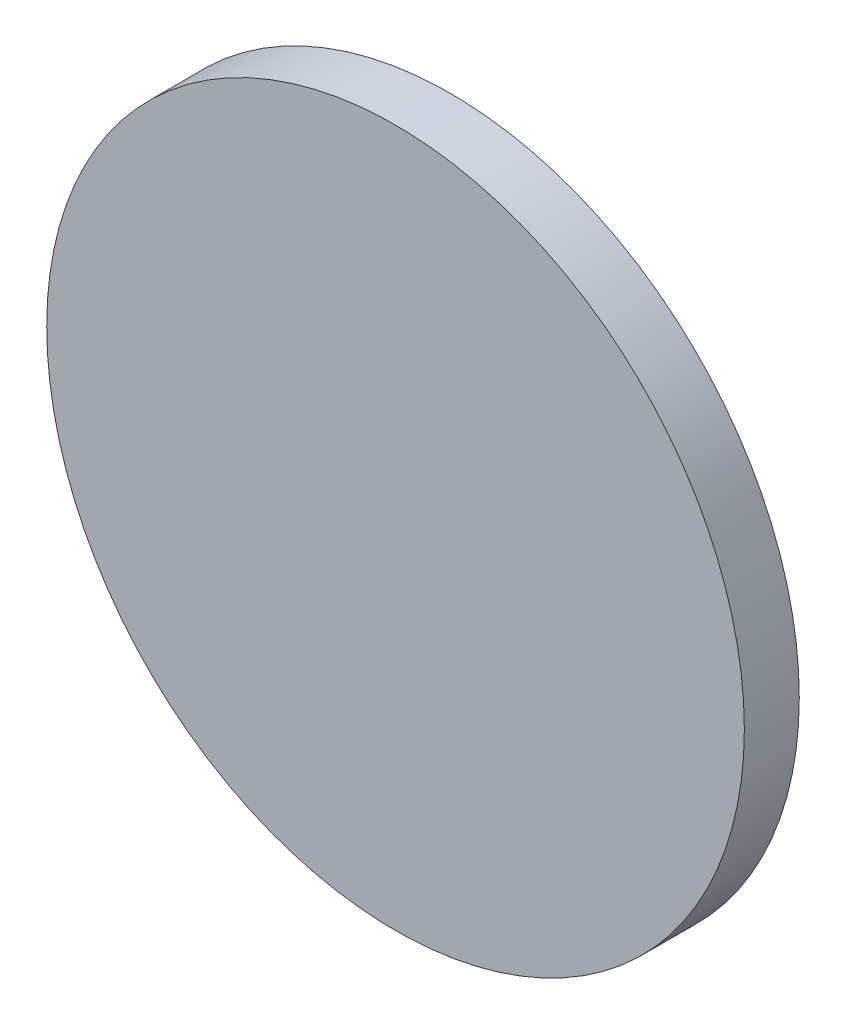
ISO-10303-21;
HEADER;
FILE_DESCRIPTION(('STEP AP214'),'2;1');
FILE_NAME('part.step','',(''),(''),'','','');
FILE_SCHEMA(('AUTOMOTIVE_DESIGN { 1 0 10303 214 1 1 1 1 }'));
ENDSEC;
DATA;
#1=APPLICATION_CONTEXT('core data for automotive mechanical design processes');
#2=APPLICATION_PROTOCOL_DEFINITION('international standard','automotive_design',2000,#1);
#3=PRODUCT_CONTEXT('',#1,'mechanical');
#4=PRODUCT('Part','Part','',(#3));
#5=PRODUCT_RELATED_PRODUCT_CATEGORY('part','',(#4));
#6=PRODUCT_DEFINITION_FORMATION('','',#4);
#7=PRODUCT_DEFINITION_CONTEXT('part definition',#1,'design');
#8=PRODUCT_DEFINITION('design','',#6,#7);
#9=PRODUCT_DEFINITION_SHAPE('','',#8);
#10=(LENGTH_UNIT() NAMED_UNIT(*) SI_UNIT(.MILLI.,.METRE.));
#11=(NAMED_UNIT(*) PLANE_ANGLE_UNIT() SI_UNIT($,.RADIAN.));
#12=(NAMED_UNIT(*) SI_UNIT($,.STERADIAN.) SOLID_ANGLE_UNIT());
#13=UNCERTAINTY_MEASURE_WITH_UNIT(LENGTH_MEASURE(1.E-05),#10,'distance_accuracy_value','');
#14=(GEOMETRIC_REPRESENTATION_CONTEXT(3) GLOBAL_UNCERTAINTY_ASSIGNED_CONTEXT((#13)) GLOBAL_UNIT_ASSIGNED_CONTEXT((#10,
#11,#12)) REPRESENTATION_CONTEXT('',''));
#15=CARTESIAN_POINT('',(0.,0.,0.));
#16=DIRECTION('',(0.,0.,1.));
#17=DIRECTION('',(1.,0.,0.));
#18=AXIS2_PLACEMENT_3D('',#15,#16,#17);
#19=CARTESIAN_POINT('',(0.,0.,2.));
#20=DIRECTION('',(0.,0.,-1.));
#21=DIRECTION('',(-1.,0.,0.));
#22=AXIS2_PLACEMENT_3D('',#19,#20,#21);
#23=CYLINDRICAL_SURFACE('',#22,12.7);
#24=CARTESIAN_POINT('',(0.,0.,2.));
#25=DIRECTION('',(0.,0.,1.));
#26=DIRECTION('',(1.,0.,0.));
#27=AXIS2_PLACEMENT_3D('',#24,#25,#26);
#28=CIRCLE('',#27,12.7);
#29=CARTESIAN_POINT('',(12.7,0.,2.));
#30=VERTEX_POINT('',#29);
#31=EDGE_CURVE('E10',#30,#30,#28,.T.);
#32=ORIENTED_EDGE('',*,*,#31,.F.);
#33=EDGE_LOOP('',(#32));
#34=FACE_BOUND('',#33,.T.);
#35=CARTESIAN_POINT('',(0.,0.,0.));
#36=DIRECTION('',(0.,0.,1.));
#37=DIRECTION('',(1.,0.,0.));
#38=AXIS2_PLACEMENT_3D('',#35,#36,#37);
#39=CIRCLE('',#38,12.7);
#40=CARTESIAN_POINT('',(12.7,0.,0.));
#41=VERTEX_POINT('',#40);
#42=EDGE_CURVE('E38',#41,#41,#39,.T.);
#43=ORIENTED_EDGE('',*,*,#42,.T.);
#44=EDGE_LOOP('',(#43));
#45=FACE_BOUND('',#44,.T.);
#46=ADVANCED_FACE('F35',(#34,#45),#23,.T.);
#47=CARTESIAN_POINT('',(0.,0.,2.));
#48=DIRECTION('',(0.,0.,1.));
#49=DIRECTION('',(1.,0.,0.));
#50=AXIS2_PLACEMENT_3D('',#47,#48,#49);
#51=PLANE('',#50);
#52=ORIENTED_EDGE('',*,*,#31,.T.);
#53=EDGE_LOOP('',(#52));
#54=FACE_BOUND('',#53,.T.);
#55=ADVANCED_FACE('F50',(#54),#51,.T.);
#56=CARTESIAN_POINT('',(0.,0.,0.));
#57=DIRECTION('',(0.,0.,1.));
#58=DIRECTION('',(1.,0.,0.));
#59=AXIS2_PLACEMENT_3D('',#56,#57,#58);
#60=PLANE('',#59);
#61=ORIENTED_EDGE('',*,*,#42,.F.);
#62=EDGE_LOOP('',(#61));
#63=FACE_BOUND('',#62,.T.);
#64=ADVANCED_FACE('F48',(#63),#60,.F.);
#65=CLOSED_SHELL('',(#46,#55,#64));
#66=MANIFOLD_SOLID_BREP('B2',#65);
#67=ADVANCED_BREP_SHAPE_REPRESENTATION('',(#18,#66),#14);
#68=SHAPE_DEFINITION_REPRESENTATION(#9,#67);
ENDSEC;
END-ISO-10303-21;
